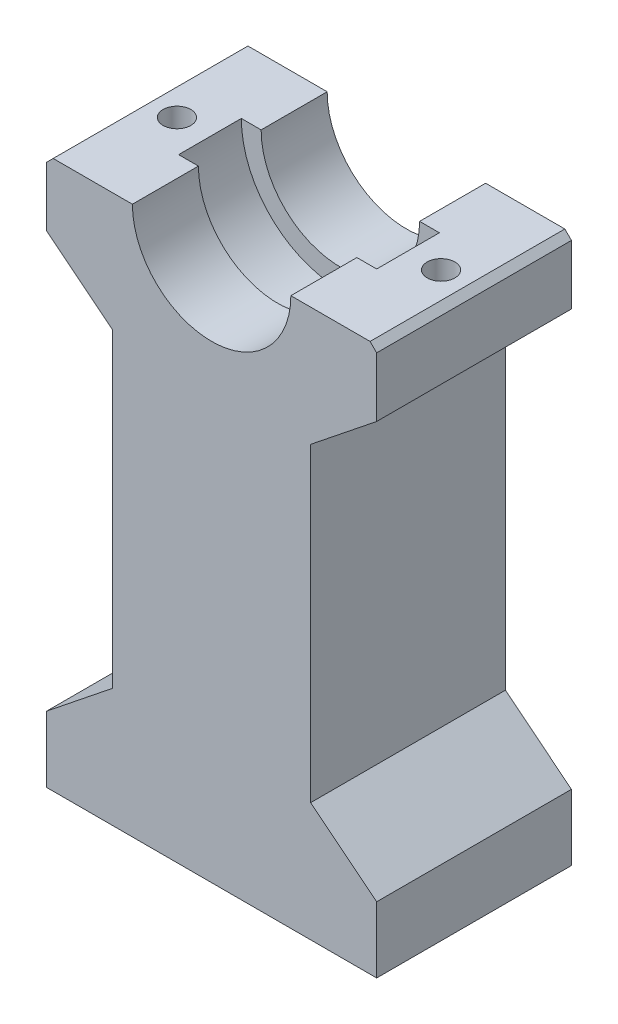
ISO-10303-21;
HEADER;
FILE_DESCRIPTION(('STEP AP214'),'2;1');
FILE_NAME('part.step','',(''),(''),'','','');
FILE_SCHEMA(('AUTOMOTIVE_DESIGN { 1 0 10303 214 1 1 1 1 }'));
ENDSEC;
DATA;
#1=APPLICATION_CONTEXT('core data for automotive mechanical design processes');
#2=APPLICATION_PROTOCOL_DEFINITION('international standard','automotive_design',2000,#1);
#3=PRODUCT_CONTEXT('',#1,'mechanical');
#4=PRODUCT('Part','Part','',(#3));
#5=PRODUCT_RELATED_PRODUCT_CATEGORY('part','',(#4));
#6=PRODUCT_DEFINITION_FORMATION('','',#4);
#7=PRODUCT_DEFINITION_CONTEXT('part definition',#1,'design');
#8=PRODUCT_DEFINITION('design','',#6,#7);
#9=PRODUCT_DEFINITION_SHAPE('','',#8);
#10=(LENGTH_UNIT() NAMED_UNIT(*) SI_UNIT(.MILLI.,.METRE.));
#11=(NAMED_UNIT(*) PLANE_ANGLE_UNIT() SI_UNIT($,.RADIAN.));
#12=(NAMED_UNIT(*) SI_UNIT($,.STERADIAN.) SOLID_ANGLE_UNIT());
#13=UNCERTAINTY_MEASURE_WITH_UNIT(LENGTH_MEASURE(1.E-05),#10,'distance_accuracy_value','');
#14=(GEOMETRIC_REPRESENTATION_CONTEXT(3) GLOBAL_UNCERTAINTY_ASSIGNED_CONTEXT((#13)) GLOBAL_UNIT_ASSIGNED_CONTEXT((#10,
#11,#12)) REPRESENTATION_CONTEXT('',''));
#15=CARTESIAN_POINT('',(0.,0.,0.));
#16=DIRECTION('',(0.,0.,1.));
#17=DIRECTION('',(1.,0.,0.));
#18=AXIS2_PLACEMENT_3D('',#15,#16,#17);
#19=CARTESIAN_POINT('',(-25.,0.,29.5));
#20=DIRECTION('',(0.,-1.,0.));
#21=DIRECTION('',(1.,0.,0.));
#22=AXIS2_PLACEMENT_3D('',#19,#20,#21);
#23=PLANE('',#22);
#24=DIRECTION('',(-1.,0.,0.));
#25=VECTOR('',#24,1.);
#26=CARTESIAN_POINT('',(-25.,0.,0.));
#27=LINE('',#26,#25);
#28=CARTESIAN_POINT('',(-12.,0.,0.));
#29=VERTEX_POINT('',#28);
#30=CARTESIAN_POINT('',(-24.,0.,0.));
#31=VERTEX_POINT('',#30);
#32=EDGE_CURVE('E276',#29,#31,#27,.T.);
#33=ORIENTED_EDGE('',*,*,#32,.T.);
#34=DIRECTION('',(0.,0.,1.));
#35=VECTOR('',#34,1.);
#36=CARTESIAN_POINT('',(-24.,0.,29.5));
#37=LINE('',#36,#35);
#38=CARTESIAN_POINT('',(-24.,0.,29.5));
#39=VERTEX_POINT('',#38);
#40=EDGE_CURVE('E11',#31,#39,#37,.T.);
#41=ORIENTED_EDGE('',*,*,#40,.T.);
#42=DIRECTION('',(-1.,0.,0.));
#43=VECTOR('',#42,1.);
#44=CARTESIAN_POINT('',(-25.,0.,29.5));
#45=LINE('',#44,#43);
#46=CARTESIAN_POINT('',(-12.,0.,29.5));
#47=VERTEX_POINT('',#46);
#48=EDGE_CURVE('E401',#47,#39,#45,.T.);
#49=ORIENTED_EDGE('',*,*,#48,.F.);
#50=DIRECTION('',(0.,0.,-1.));
#51=VECTOR('',#50,1.);
#52=CARTESIAN_POINT('',(-12.,0.,29.5));
#53=LINE('',#52,#51);
#54=CARTESIAN_POINT('',(-12.,0.,19.5));
#55=VERTEX_POINT('',#54);
#56=EDGE_CURVE('E326',#47,#55,#53,.T.);
#57=ORIENTED_EDGE('',*,*,#56,.T.);
#58=DIRECTION('',(-1.,0.,0.));
#59=VECTOR('',#58,1.);
#60=CARTESIAN_POINT('',(-25.,0.,19.5));
#61=LINE('',#60,#59);
#62=CARTESIAN_POINT('',(-15.,0.,19.5));
#63=VERTEX_POINT('',#62);
#64=EDGE_CURVE('E243',#55,#63,#61,.T.);
#65=ORIENTED_EDGE('',*,*,#64,.T.);
#66=DIRECTION('',(0.,0.,-1.));
#67=VECTOR('',#66,1.);
#68=CARTESIAN_POINT('',(-15.,0.,0.));
#69=LINE('',#68,#67);
#70=CARTESIAN_POINT('',(-15.,0.,10.));
#71=VERTEX_POINT('',#70);
#72=EDGE_CURVE('E228',#63,#71,#69,.T.);
#73=ORIENTED_EDGE('',*,*,#72,.T.);
#74=DIRECTION('',(1.,0.,0.));
#75=VECTOR('',#74,1.);
#76=CARTESIAN_POINT('',(-25.,0.,10.));
#77=LINE('',#76,#75);
#78=CARTESIAN_POINT('',(-12.,0.,10.));
#79=VERTEX_POINT('',#78);
#80=EDGE_CURVE('E219',#71,#79,#77,.T.);
#81=ORIENTED_EDGE('',*,*,#80,.T.);
#82=EDGE_CURVE('E325',#79,#29,#53,.T.);
#83=ORIENTED_EDGE('',*,*,#82,.T.);
#84=EDGE_LOOP('',(#33,#41,#49,#57,#65,#73,#81,#83));
#85=FACE_BOUND('',#84,.T.);
#86=CARTESIAN_POINT('',(-20.,0.,14.75));
#87=DIRECTION('',(0.,1.,0.));
#88=DIRECTION('',(0.,0.,1.));
#89=AXIS2_PLACEMENT_3D('',#86,#87,#88);
#90=CIRCLE('',#89,2.09999999999999);
#91=CARTESIAN_POINT('',(-20.,0.,16.85));
#92=VERTEX_POINT('',#91);
#93=EDGE_CURVE('E849',#92,#92,#90,.T.);
#94=ORIENTED_EDGE('',*,*,#93,.F.);
#95=EDGE_LOOP('',(#94));
#96=FACE_BOUND('',#95,.T.);
#97=ADVANCED_FACE('F40',(#85,#96),#23,.F.);
#98=CARTESIAN_POINT('',(0.,0.,29.5));
#99=DIRECTION('',(0.,0.,-1.));
#100=DIRECTION('',(-1.,0.,0.));
#101=AXIS2_PLACEMENT_3D('',#98,#99,#100);
#102=CYLINDRICAL_SURFACE('',#101,12.);
#103=DIRECTION('',(0.,0.,-1.));
#104=VECTOR('',#103,1.);
#105=CARTESIAN_POINT('',(12.,0.,29.5));
#106=LINE('',#105,#104);
#107=CARTESIAN_POINT('',(12.,0.,29.5));
#108=VERTEX_POINT('',#107);
#109=CARTESIAN_POINT('',(12.,0.,19.5));
#110=VERTEX_POINT('',#109);
#111=EDGE_CURVE('E329',#108,#110,#106,.T.);
#112=ORIENTED_EDGE('',*,*,#111,.T.);
#113=CARTESIAN_POINT('',(0.,0.,19.5));
#114=DIRECTION('',(0.,0.,1.));
#115=DIRECTION('',(1.,0.,0.));
#116=AXIS2_PLACEMENT_3D('',#113,#114,#115);
#117=CIRCLE('',#116,12.);
#118=EDGE_CURVE('E582',#110,#55,#117,.F.);
#119=ORIENTED_EDGE('',*,*,#118,.T.);
#120=ORIENTED_EDGE('',*,*,#56,.F.);
#121=CARTESIAN_POINT('',(0.,0.,29.5));
#122=DIRECTION('',(0.,0.,-1.));
#123=DIRECTION('',(1.,0.,0.));
#124=AXIS2_PLACEMENT_3D('',#121,#122,#123);
#125=CIRCLE('',#124,12.);
#126=EDGE_CURVE('E399',#108,#47,#125,.T.);
#127=ORIENTED_EDGE('',*,*,#126,.F.);
#128=EDGE_LOOP('',(#112,#119,#120,#127));
#129=FACE_BOUND('',#128,.T.);
#130=ADVANCED_FACE('F439',(#129),#102,.F.);
#131=CARTESIAN_POINT('',(25.,-83.,29.5));
#132=DIRECTION('',(0.,1.,0.));
#133=DIRECTION('',(0.,0.,1.));
#134=AXIS2_PLACEMENT_3D('',#131,#132,#133);
#135=PLANE('',#134);
#136=CARTESIAN_POINT('',(0.,-83.,23.3625));
#137=DIRECTION('',(0.,-1.,0.));
#138=DIRECTION('',(0.,0.,-1.));
#139=AXIS2_PLACEMENT_3D('',#136,#137,#138);
#140=CIRCLE('',#139,2.1);
#141=CARTESIAN_POINT('',(0.,-83.,21.2625));
#142=VERTEX_POINT('',#141);
#143=EDGE_CURVE('E592',#142,#142,#140,.T.);
#144=ORIENTED_EDGE('',*,*,#143,.F.);
#145=EDGE_LOOP('',(#144));
#146=FACE_BOUND('',#145,.T.);
#147=CARTESIAN_POINT('',(0.,-83.,6.1375));
#148=DIRECTION('',(0.,-1.,0.));
#149=DIRECTION('',(0.,0.,-1.));
#150=AXIS2_PLACEMENT_3D('',#147,#148,#149);
#151=CIRCLE('',#150,2.1);
#152=CARTESIAN_POINT('',(0.,-83.,4.0375));
#153=VERTEX_POINT('',#152);
#154=EDGE_CURVE('E597',#153,#153,#151,.T.);
#155=ORIENTED_EDGE('',*,*,#154,.F.);
#156=EDGE_LOOP('',(#155));
#157=FACE_BOUND('',#156,.T.);
#158=DIRECTION('',(1.,0.,0.));
#159=VECTOR('',#158,1.);
#160=CARTESIAN_POINT('',(25.,-83.,0.));
#161=LINE('',#160,#159);
#162=CARTESIAN_POINT('',(-25.,-83.,0.));
#163=VERTEX_POINT('',#162);
#164=CARTESIAN_POINT('',(25.,-83.,0.));
#165=VERTEX_POINT('',#164);
#166=EDGE_CURVE('E289',#163,#165,#161,.T.);
#167=ORIENTED_EDGE('',*,*,#166,.T.);
#168=DIRECTION('',(0.,0.,-1.));
#169=VECTOR('',#168,1.);
#170=CARTESIAN_POINT('',(25.,-83.,29.5));
#171=LINE('',#170,#169);
#172=CARTESIAN_POINT('',(25.,-83.,29.5));
#173=VERTEX_POINT('',#172);
#174=EDGE_CURVE('E308',#173,#165,#171,.T.);
#175=ORIENTED_EDGE('',*,*,#174,.F.);
#176=DIRECTION('',(1.,0.,0.));
#177=VECTOR('',#176,1.);
#178=CARTESIAN_POINT('',(25.,-83.,29.5));
#179=LINE('',#178,#177);
#180=CARTESIAN_POINT('',(-25.,-83.,29.5));
#181=VERTEX_POINT('',#180);
#182=EDGE_CURVE('E412',#181,#173,#179,.T.);
#183=ORIENTED_EDGE('',*,*,#182,.F.);
#184=DIRECTION('',(0.,0.,-1.));
#185=VECTOR('',#184,1.);
#186=CARTESIAN_POINT('',(-25.,-83.,29.5));
#187=LINE('',#186,#185);
#188=EDGE_CURVE('E311',#181,#163,#187,.T.);
#189=ORIENTED_EDGE('',*,*,#188,.T.);
#190=EDGE_LOOP('',(#167,#175,#183,#189));
#191=FACE_BOUND('',#190,.T.);
#192=CARTESIAN_POINT('',(10.,-83.,14.75));
#193=DIRECTION('',(0.,-1.,0.));
#194=DIRECTION('',(0.,0.,1.));
#195=AXIS2_PLACEMENT_3D('',#192,#193,#194);
#196=CIRCLE('',#195,2.475);
#197=CARTESIAN_POINT('',(10.,-83.,12.275));
#198=VERTEX_POINT('',#197);
#199=CARTESIAN_POINT('',(10.,-83.,17.225));
#200=VERTEX_POINT('',#199);
#201=EDGE_CURVE('E361',#198,#200,#196,.T.);
#202=ORIENTED_EDGE('',*,*,#201,.F.);
#203=DIRECTION('',(1.,0.,0.));
#204=VECTOR('',#203,1.);
#205=CARTESIAN_POINT('',(-10.,-83.,12.275));
#206=LINE('',#205,#204);
#207=CARTESIAN_POINT('',(-10.,-83.,12.275));
#208=VERTEX_POINT('',#207);
#209=EDGE_CURVE('E380',#208,#198,#206,.T.);
#210=ORIENTED_EDGE('',*,*,#209,.F.);
#211=CARTESIAN_POINT('',(-10.,-83.,14.75));
#212=DIRECTION('',(0.,-1.,0.));
#213=DIRECTION('',(0.,0.,-1.));
#214=AXIS2_PLACEMENT_3D('',#211,#212,#213);
#215=CIRCLE('',#214,2.475);
#216=CARTESIAN_POINT('',(-10.,-83.,17.225));
#217=VERTEX_POINT('',#216);
#218=EDGE_CURVE('E373',#217,#208,#215,.T.);
#219=ORIENTED_EDGE('',*,*,#218,.F.);
#220=DIRECTION('',(-1.,0.,0.));
#221=VECTOR('',#220,1.);
#222=CARTESIAN_POINT('',(-10.,-83.,17.225));
#223=LINE('',#222,#221);
#224=EDGE_CURVE('E367',#200,#217,#223,.T.);
#225=ORIENTED_EDGE('',*,*,#224,.F.);
#226=EDGE_LOOP('',(#202,#210,#219,#225));
#227=FACE_BOUND('',#226,.T.);
#228=ADVANCED_FACE('F444',(#146,#157,#191,#227),#135,.F.);
#229=CARTESIAN_POINT('',(25.,-10.,29.5));
#230=DIRECTION('',(-0.624695047554423,0.780868809443031,0.));
#231=DIRECTION('',(-0.780868809443031,-0.624695047554423,0.));
#232=AXIS2_PLACEMENT_3D('',#229,#230,#231);
#233=PLANE('',#232);
#234=CARTESIAN_POINT('',(20.,-14.,14.75));
#235=DIRECTION('',(-0.624695047554423,0.780868809443031,0.));
#236=DIRECTION('',(0.780868809443031,0.624695047554423,0.));
#237=AXIS2_PLACEMENT_3D('',#234,#235,#236);
#238=ELLIPSE('',#237,2.68931217972178,2.09999999999999);
#239=CARTESIAN_POINT('',(22.1,-12.32,14.75));
#240=VERTEX_POINT('',#239);
#241=EDGE_CURVE('E238',#240,#240,#238,.T.);
#242=ORIENTED_EDGE('',*,*,#241,.T.);
#243=EDGE_LOOP('',(#242));
#244=FACE_BOUND('',#243,.T.);
#245=DIRECTION('',(0.780868809443031,0.624695047554423,0.));
#246=VECTOR('',#245,1.);
#247=CARTESIAN_POINT('',(25.,-10.,0.));
#248=LINE('',#247,#246);
#249=CARTESIAN_POINT('',(15.,-18.,0.));
#250=VERTEX_POINT('',#249);
#251=CARTESIAN_POINT('',(25.,-10.,0.));
#252=VERTEX_POINT('',#251);
#253=EDGE_CURVE('E391',#250,#252,#248,.T.);
#254=ORIENTED_EDGE('',*,*,#253,.T.);
#255=DIRECTION('',(0.,0.,-1.));
#256=VECTOR('',#255,1.);
#257=CARTESIAN_POINT('',(25.,-10.,29.5));
#258=LINE('',#257,#256);
#259=CARTESIAN_POINT('',(25.,-10.,29.5));
#260=VERTEX_POINT('',#259);
#261=EDGE_CURVE('E332',#260,#252,#258,.T.);
#262=ORIENTED_EDGE('',*,*,#261,.F.);
#263=DIRECTION('',(0.780868809443031,0.624695047554423,0.));
#264=VECTOR('',#263,1.);
#265=CARTESIAN_POINT('',(25.,-10.,29.5));
#266=LINE('',#265,#264);
#267=CARTESIAN_POINT('',(15.,-18.,29.5));
#268=VERTEX_POINT('',#267);
#269=EDGE_CURVE('E297',#268,#260,#266,.T.);
#270=ORIENTED_EDGE('',*,*,#269,.F.);
#271=DIRECTION('',(0.,0.,-1.));
#272=VECTOR('',#271,1.);
#273=CARTESIAN_POINT('',(15.,-18.,29.5));
#274=LINE('',#273,#272);
#275=EDGE_CURVE('E298',#268,#250,#274,.T.);
#276=ORIENTED_EDGE('',*,*,#275,.T.);
#277=EDGE_LOOP('',(#254,#262,#270,#276));
#278=FACE_BOUND('',#277,.T.);
#279=ADVANCED_FACE('F458',(#244,#278),#233,.F.);
#280=CARTESIAN_POINT('',(25.,0.,29.5));
#281=DIRECTION('',(-1.,0.,0.));
#282=DIRECTION('',(0.,0.,1.));
#283=AXIS2_PLACEMENT_3D('',#280,#281,#282);
#284=PLANE('',#283);
#285=DIRECTION('',(0.,1.,0.));
#286=VECTOR('',#285,1.);
#287=CARTESIAN_POINT('',(25.,0.,0.));
#288=LINE('',#287,#286);
#289=CARTESIAN_POINT('',(25.,-1.00000000000003,0.));
#290=VERTEX_POINT('',#289);
#291=EDGE_CURVE('E421',#252,#290,#288,.T.);
#292=ORIENTED_EDGE('',*,*,#291,.T.);
#293=DIRECTION('',(0.,0.,1.));
#294=VECTOR('',#293,1.);
#295=CARTESIAN_POINT('',(25.,-1.00000000000003,29.5));
#296=LINE('',#295,#294);
#297=CARTESIAN_POINT('',(25.,-1.00000000000003,29.5));
#298=VERTEX_POINT('',#297);
#299=EDGE_CURVE('E255',#290,#298,#296,.T.);
#300=ORIENTED_EDGE('',*,*,#299,.T.);
#301=DIRECTION('',(0.,1.,0.));
#302=VECTOR('',#301,1.);
#303=CARTESIAN_POINT('',(25.,0.,29.5));
#304=LINE('',#303,#302);
#305=EDGE_CURVE('E394',#260,#298,#304,.T.);
#306=ORIENTED_EDGE('',*,*,#305,.F.);
#307=ORIENTED_EDGE('',*,*,#261,.T.);
#308=EDGE_LOOP('',(#292,#300,#306,#307));
#309=FACE_BOUND('',#308,.T.);
#310=ADVANCED_FACE('F454',(#309),#284,.F.);
#311=CARTESIAN_POINT('',(12.,0.,29.5));
#312=DIRECTION('',(0.,-1.,0.));
#313=DIRECTION('',(1.,0.,0.));
#314=AXIS2_PLACEMENT_3D('',#311,#312,#313);
#315=PLANE('',#314);
#316=CARTESIAN_POINT('',(20.,0.,14.75));
#317=DIRECTION('',(0.,1.,0.));
#318=DIRECTION('',(0.,0.,1.));
#319=AXIS2_PLACEMENT_3D('',#316,#317,#318);
#320=CIRCLE('',#319,2.09999999999999);
#321=CARTESIAN_POINT('',(20.,0.,16.85));
#322=VERTEX_POINT('',#321);
#323=EDGE_CURVE('E851',#322,#322,#320,.T.);
#324=ORIENTED_EDGE('',*,*,#323,.F.);
#325=EDGE_LOOP('',(#324));
#326=FACE_BOUND('',#325,.T.);
#327=DIRECTION('',(-1.,0.,0.));
#328=VECTOR('',#327,1.);
#329=CARTESIAN_POINT('',(12.,0.,29.5));
#330=LINE('',#329,#328);
#331=CARTESIAN_POINT('',(24.,0.,29.5));
#332=VERTEX_POINT('',#331);
#333=EDGE_CURVE('E397',#332,#108,#330,.T.);
#334=ORIENTED_EDGE('',*,*,#333,.F.);
#335=DIRECTION('',(0.,0.,-1.));
#336=VECTOR('',#335,1.);
#337=CARTESIAN_POINT('',(24.,0.,29.5));
#338=LINE('',#337,#336);
#339=CARTESIAN_POINT('',(24.,0.,0.));
#340=VERTEX_POINT('',#339);
#341=EDGE_CURVE('E245',#332,#340,#338,.T.);
#342=ORIENTED_EDGE('',*,*,#341,.T.);
#343=DIRECTION('',(-1.,0.,0.));
#344=VECTOR('',#343,1.);
#345=CARTESIAN_POINT('',(12.,0.,0.));
#346=LINE('',#345,#344);
#347=CARTESIAN_POINT('',(12.,0.,0.));
#348=VERTEX_POINT('',#347);
#349=EDGE_CURVE('E424',#340,#348,#346,.T.);
#350=ORIENTED_EDGE('',*,*,#349,.T.);
#351=CARTESIAN_POINT('',(12.,0.,10.));
#352=VERTEX_POINT('',#351);
#353=EDGE_CURVE('E328',#352,#348,#106,.T.);
#354=ORIENTED_EDGE('',*,*,#353,.F.);
#355=DIRECTION('',(1.,0.,0.));
#356=VECTOR('',#355,1.);
#357=CARTESIAN_POINT('',(12.,0.,10.));
#358=LINE('',#357,#356);
#359=CARTESIAN_POINT('',(15.,0.,10.));
#360=VERTEX_POINT('',#359);
#361=EDGE_CURVE('E585',#352,#360,#358,.T.);
#362=ORIENTED_EDGE('',*,*,#361,.T.);
#363=DIRECTION('',(0.,0.,-1.));
#364=VECTOR('',#363,1.);
#365=CARTESIAN_POINT('',(15.,0.,0.));
#366=LINE('',#365,#364);
#367=CARTESIAN_POINT('',(15.,0.,19.5));
#368=VERTEX_POINT('',#367);
#369=EDGE_CURVE('E236',#360,#368,#366,.F.);
#370=ORIENTED_EDGE('',*,*,#369,.T.);
#371=DIRECTION('',(-1.,0.,0.));
#372=VECTOR('',#371,1.);
#373=CARTESIAN_POINT('',(12.,0.,19.5));
#374=LINE('',#373,#372);
#375=EDGE_CURVE('E584',#368,#110,#374,.T.);
#376=ORIENTED_EDGE('',*,*,#375,.T.);
#377=ORIENTED_EDGE('',*,*,#111,.F.);
#378=EDGE_LOOP('',(#334,#342,#350,#354,#362,#370,#376,#377));
#379=FACE_BOUND('',#378,.T.);
#380=ADVANCED_FACE('F451',(#326,#379),#315,.F.);
#381=ORIENTED_EDGE('',*,*,#82,.F.);
#382=CARTESIAN_POINT('',(0.,0.,10.));
#383=DIRECTION('',(0.,0.,-1.));
#384=DIRECTION('',(-1.,0.,0.));
#385=AXIS2_PLACEMENT_3D('',#382,#383,#384);
#386=CIRCLE('',#385,12.);
#387=EDGE_CURVE('E225',#79,#352,#386,.F.);
#388=ORIENTED_EDGE('',*,*,#387,.T.);
#389=ORIENTED_EDGE('',*,*,#353,.T.);
#390=CARTESIAN_POINT('',(0.,0.,0.));
#391=DIRECTION('',(0.,0.,-1.));
#392=DIRECTION('',(1.,0.,0.));
#393=AXIS2_PLACEMENT_3D('',#390,#391,#392);
#394=CIRCLE('',#393,12.);
#395=EDGE_CURVE('E280',#348,#29,#394,.T.);
#396=ORIENTED_EDGE('',*,*,#395,.T.);
#397=EDGE_LOOP('',(#381,#388,#389,#396));
#398=FACE_BOUND('',#397,.T.);
#399=ADVANCED_FACE('F429',(#398),#102,.F.);
#400=CARTESIAN_POINT('',(-25.,-9.99999999999994,29.5));
#401=DIRECTION('',(1.,0.,0.));
#402=DIRECTION('',(0.,0.,-1.));
#403=AXIS2_PLACEMENT_3D('',#400,#401,#402);
#404=PLANE('',#403);
#405=DIRECTION('',(0.,-1.,0.));
#406=VECTOR('',#405,1.);
#407=CARTESIAN_POINT('',(-25.,-9.99999999999994,29.5));
#408=LINE('',#407,#406);
#409=CARTESIAN_POINT('',(-25.,-1.00000000000001,29.5));
#410=VERTEX_POINT('',#409);
#411=CARTESIAN_POINT('',(-25.,-9.99999999999994,29.5));
#412=VERTEX_POINT('',#411);
#413=EDGE_CURVE('E267',#410,#412,#408,.T.);
#414=ORIENTED_EDGE('',*,*,#413,.F.);
#415=DIRECTION('',(0.,0.,-1.));
#416=VECTOR('',#415,1.);
#417=CARTESIAN_POINT('',(-25.,-1.00000000000001,29.5));
#418=LINE('',#417,#416);
#419=CARTESIAN_POINT('',(-25.,-1.00000000000001,0.));
#420=VERTEX_POINT('',#419);
#421=EDGE_CURVE('E48',#410,#420,#418,.T.);
#422=ORIENTED_EDGE('',*,*,#421,.T.);
#423=DIRECTION('',(0.,-1.,0.));
#424=VECTOR('',#423,1.);
#425=CARTESIAN_POINT('',(-25.,-9.99999999999994,0.));
#426=LINE('',#425,#424);
#427=CARTESIAN_POINT('',(-25.,-9.99999999999994,0.));
#428=VERTEX_POINT('',#427);
#429=EDGE_CURVE('E265',#420,#428,#426,.T.);
#430=ORIENTED_EDGE('',*,*,#429,.T.);
#431=DIRECTION('',(0.,0.,-1.));
#432=VECTOR('',#431,1.);
#433=CARTESIAN_POINT('',(-25.,-9.99999999999994,29.5));
#434=LINE('',#433,#432);
#435=EDGE_CURVE('E323',#412,#428,#434,.T.);
#436=ORIENTED_EDGE('',*,*,#435,.F.);
#437=EDGE_LOOP('',(#414,#422,#430,#436));
#438=FACE_BOUND('',#437,.T.);
#439=ADVANCED_FACE('F263',(#438),#404,.F.);
#440=CARTESIAN_POINT('',(-25.,-9.99999999999994,29.5));
#441=DIRECTION('',(0.624695047554427,0.780868809443028,0.));
#442=DIRECTION('',(-0.780868809443028,0.624695047554427,0.));
#443=AXIS2_PLACEMENT_3D('',#440,#441,#442);
#444=PLANE('',#443);
#445=CARTESIAN_POINT('',(-20.,-14.,14.75));
#446=DIRECTION('',(0.624695047554427,0.780868809443028,0.));
#447=DIRECTION('',(-0.780868809443028,0.624695047554427,0.));
#448=AXIS2_PLACEMENT_3D('',#445,#446,#447);
#449=ELLIPSE('',#448,2.68931217972179,2.09999999999999);
#450=CARTESIAN_POINT('',(-22.1,-12.32,14.75));
#451=VERTEX_POINT('',#450);
#452=EDGE_CURVE('E538',#451,#451,#449,.T.);
#453=ORIENTED_EDGE('',*,*,#452,.T.);
#454=EDGE_LOOP('',(#453));
#455=FACE_BOUND('',#454,.T.);
#456=DIRECTION('',(0.780868809443028,-0.624695047554427,0.));
#457=VECTOR('',#456,1.);
#458=CARTESIAN_POINT('',(-25.,-9.99999999999994,0.));
#459=LINE('',#458,#457);
#460=CARTESIAN_POINT('',(-15.,-18.,0.));
#461=VERTEX_POINT('',#460);
#462=EDGE_CURVE('E275',#428,#461,#459,.T.);
#463=ORIENTED_EDGE('',*,*,#462,.T.);
#464=DIRECTION('',(0.,0.,-1.));
#465=VECTOR('',#464,1.);
#466=CARTESIAN_POINT('',(-15.,-18.,29.5));
#467=LINE('',#466,#465);
#468=CARTESIAN_POINT('',(-15.,-18.,29.5));
#469=VERTEX_POINT('',#468);
#470=EDGE_CURVE('E320',#469,#461,#467,.T.);
#471=ORIENTED_EDGE('',*,*,#470,.F.);
#472=DIRECTION('',(0.780868809443028,-0.624695047554427,0.));
#473=VECTOR('',#472,1.);
#474=CARTESIAN_POINT('',(-25.,-9.99999999999994,29.5));
#475=LINE('',#474,#473);
#476=EDGE_CURVE('E404',#412,#469,#475,.T.);
#477=ORIENTED_EDGE('',*,*,#476,.F.);
#478=ORIENTED_EDGE('',*,*,#435,.T.);
#479=EDGE_LOOP('',(#463,#471,#477,#478));
#480=FACE_BOUND('',#479,.T.);
#481=ADVANCED_FACE('F528',(#455,#480),#444,.F.);
#482=CARTESIAN_POINT('',(-15.,-18.,29.5));
#483=DIRECTION('',(1.,0.,0.));
#484=DIRECTION('',(0.,0.,-1.));
#485=AXIS2_PLACEMENT_3D('',#482,#483,#484);
#486=PLANE('',#485);
#487=DIRECTION('',(0.,-1.,0.));
#488=VECTOR('',#487,1.);
#489=CARTESIAN_POINT('',(-15.,-18.,0.));
#490=LINE('',#489,#488);
#491=CARTESIAN_POINT('',(-15.,-65.,0.));
#492=VERTEX_POINT('',#491);
#493=EDGE_CURVE('E278',#461,#492,#490,.T.);
#494=ORIENTED_EDGE('',*,*,#493,.T.);
#495=DIRECTION('',(0.,0.,-1.));
#496=VECTOR('',#495,1.);
#497=CARTESIAN_POINT('',(-15.,-65.,29.5));
#498=LINE('',#497,#496);
#499=CARTESIAN_POINT('',(-15.,-65.,29.5));
#500=VERTEX_POINT('',#499);
#501=EDGE_CURVE('E317',#500,#492,#498,.T.);
#502=ORIENTED_EDGE('',*,*,#501,.F.);
#503=DIRECTION('',(0.,-1.,0.));
#504=VECTOR('',#503,1.);
#505=CARTESIAN_POINT('',(-15.,-18.,29.5));
#506=LINE('',#505,#504);
#507=EDGE_CURVE('E406',#469,#500,#506,.T.);
#508=ORIENTED_EDGE('',*,*,#507,.F.);
#509=ORIENTED_EDGE('',*,*,#470,.T.);
#510=EDGE_LOOP('',(#494,#502,#508,#509));
#511=FACE_BOUND('',#510,.T.);
#512=ADVANCED_FACE('F525',(#511),#486,.F.);
#513=CARTESIAN_POINT('',(-15.,-65.,29.5));
#514=DIRECTION('',(0.624695047554425,-0.78086880944303,0.));
#515=DIRECTION('',(0.78086880944303,0.624695047554425,0.));
#516=AXIS2_PLACEMENT_3D('',#513,#514,#515);
#517=PLANE('',#516);
#518=DIRECTION('',(-0.78086880944303,-0.624695047554425,0.));
#519=VECTOR('',#518,1.);
#520=CARTESIAN_POINT('',(-15.,-65.,0.));
#521=LINE('',#520,#519);
#522=CARTESIAN_POINT('',(-25.,-73.,0.));
#523=VERTEX_POINT('',#522);
#524=EDGE_CURVE('E285',#492,#523,#521,.T.);
#525=ORIENTED_EDGE('',*,*,#524,.T.);
#526=DIRECTION('',(0.,0.,-1.));
#527=VECTOR('',#526,1.);
#528=CARTESIAN_POINT('',(-25.,-73.,29.5));
#529=LINE('',#528,#527);
#530=CARTESIAN_POINT('',(-25.,-73.,29.5));
#531=VERTEX_POINT('',#530);
#532=EDGE_CURVE('E314',#531,#523,#529,.T.);
#533=ORIENTED_EDGE('',*,*,#532,.F.);
#534=DIRECTION('',(-0.78086880944303,-0.624695047554425,0.));
#535=VECTOR('',#534,1.);
#536=CARTESIAN_POINT('',(-15.,-65.,29.5));
#537=LINE('',#536,#535);
#538=EDGE_CURVE('E408',#500,#531,#537,.T.);
#539=ORIENTED_EDGE('',*,*,#538,.F.);
#540=ORIENTED_EDGE('',*,*,#501,.T.);
#541=EDGE_LOOP('',(#525,#533,#539,#540));
#542=FACE_BOUND('',#541,.T.);
#543=ADVANCED_FACE('F521',(#542),#517,.F.);
#544=CARTESIAN_POINT('',(-25.,-83.,29.5));
#545=DIRECTION('',(1.,0.,0.));
#546=DIRECTION('',(0.,0.,-1.));
#547=AXIS2_PLACEMENT_3D('',#544,#545,#546);
#548=PLANE('',#547);
#549=DIRECTION('',(0.,-1.,0.));
#550=VECTOR('',#549,1.);
#551=CARTESIAN_POINT('',(-25.,-83.,0.));
#552=LINE('',#551,#550);
#553=EDGE_CURVE('E287',#523,#163,#552,.T.);
#554=ORIENTED_EDGE('',*,*,#553,.T.);
#555=ORIENTED_EDGE('',*,*,#188,.F.);
#556=DIRECTION('',(0.,-1.,0.));
#557=VECTOR('',#556,1.);
#558=CARTESIAN_POINT('',(-25.,-83.,29.5));
#559=LINE('',#558,#557);
#560=EDGE_CURVE('E410',#531,#181,#559,.T.);
#561=ORIENTED_EDGE('',*,*,#560,.F.);
#562=ORIENTED_EDGE('',*,*,#532,.T.);
#563=EDGE_LOOP('',(#554,#555,#561,#562));
#564=FACE_BOUND('',#563,.T.);
#565=ADVANCED_FACE('F518',(#564),#548,.F.);
#566=CARTESIAN_POINT('',(25.,-73.,29.5));
#567=DIRECTION('',(-1.,0.,0.));
#568=DIRECTION('',(0.,0.,1.));
#569=AXIS2_PLACEMENT_3D('',#566,#567,#568);
#570=PLANE('',#569);
#571=DIRECTION('',(0.,1.,0.));
#572=VECTOR('',#571,1.);
#573=CARTESIAN_POINT('',(25.,-73.,0.));
#574=LINE('',#573,#572);
#575=CARTESIAN_POINT('',(25.,-73.,0.));
#576=VERTEX_POINT('',#575);
#577=EDGE_CURVE('E291',#165,#576,#574,.T.);
#578=ORIENTED_EDGE('',*,*,#577,.T.);
#579=DIRECTION('',(0.,0.,-1.));
#580=VECTOR('',#579,1.);
#581=CARTESIAN_POINT('',(25.,-73.,29.5));
#582=LINE('',#581,#580);
#583=CARTESIAN_POINT('',(25.,-73.,29.5));
#584=VERTEX_POINT('',#583);
#585=EDGE_CURVE('E305',#584,#576,#582,.T.);
#586=ORIENTED_EDGE('',*,*,#585,.F.);
#587=DIRECTION('',(0.,1.,0.));
#588=VECTOR('',#587,1.);
#589=CARTESIAN_POINT('',(25.,-73.,29.5));
#590=LINE('',#589,#588);
#591=EDGE_CURVE('E414',#173,#584,#590,.T.);
#592=ORIENTED_EDGE('',*,*,#591,.F.);
#593=ORIENTED_EDGE('',*,*,#174,.T.);
#594=EDGE_LOOP('',(#578,#586,#592,#593));
#595=FACE_BOUND('',#594,.T.);
#596=ADVANCED_FACE('F516',(#595),#570,.F.);
#597=CARTESIAN_POINT('',(15.,-65.,29.5));
#598=DIRECTION('',(-0.624695047554425,-0.78086880944303,0.));
#599=DIRECTION('',(0.78086880944303,-0.624695047554425,0.));
#600=AXIS2_PLACEMENT_3D('',#597,#598,#599);
#601=PLANE('',#600);
#602=DIRECTION('',(-0.78086880944303,0.624695047554425,0.));
#603=VECTOR('',#602,1.);
#604=CARTESIAN_POINT('',(15.,-65.,0.));
#605=LINE('',#604,#603);
#606=CARTESIAN_POINT('',(15.,-65.,0.));
#607=VERTEX_POINT('',#606);
#608=EDGE_CURVE('E293',#576,#607,#605,.T.);
#609=ORIENTED_EDGE('',*,*,#608,.T.);
#610=DIRECTION('',(0.,0.,-1.));
#611=VECTOR('',#610,1.);
#612=CARTESIAN_POINT('',(15.,-65.,29.5));
#613=LINE('',#612,#611);
#614=CARTESIAN_POINT('',(15.,-65.,29.5));
#615=VERTEX_POINT('',#614);
#616=EDGE_CURVE('E301',#615,#607,#613,.T.);
#617=ORIENTED_EDGE('',*,*,#616,.F.);
#618=DIRECTION('',(-0.78086880944303,0.624695047554425,0.));
#619=VECTOR('',#618,1.);
#620=CARTESIAN_POINT('',(15.,-65.,29.5));
#621=LINE('',#620,#619);
#622=EDGE_CURVE('E416',#584,#615,#621,.T.);
#623=ORIENTED_EDGE('',*,*,#622,.F.);
#624=ORIENTED_EDGE('',*,*,#585,.T.);
#625=EDGE_LOOP('',(#609,#617,#623,#624));
#626=FACE_BOUND('',#625,.T.);
#627=ADVANCED_FACE('F562',(#626),#601,.F.);
#628=CARTESIAN_POINT('',(15.,-18.,29.5));
#629=DIRECTION('',(-1.,0.,0.));
#630=DIRECTION('',(0.,0.,1.));
#631=AXIS2_PLACEMENT_3D('',#628,#629,#630);
#632=PLANE('',#631);
#633=DIRECTION('',(0.,1.,0.));
#634=VECTOR('',#633,1.);
#635=CARTESIAN_POINT('',(15.,-18.,0.));
#636=LINE('',#635,#634);
#637=EDGE_CURVE('E295',#607,#250,#636,.T.);
#638=ORIENTED_EDGE('',*,*,#637,.T.);
#639=ORIENTED_EDGE('',*,*,#275,.F.);
#640=DIRECTION('',(0.,1.,0.));
#641=VECTOR('',#640,1.);
#642=CARTESIAN_POINT('',(15.,-18.,29.5));
#643=LINE('',#642,#641);
#644=EDGE_CURVE('E302',#615,#268,#643,.T.);
#645=ORIENTED_EDGE('',*,*,#644,.F.);
#646=ORIENTED_EDGE('',*,*,#616,.T.);
#647=EDGE_LOOP('',(#638,#639,#645,#646));
#648=FACE_BOUND('',#647,.T.);
#649=ADVANCED_FACE('F568',(#648),#632,.F.);
#650=CARTESIAN_POINT('',(0.,0.,29.5));
#651=DIRECTION('',(0.,0.,1.));
#652=DIRECTION('',(1.,0.,0.));
#653=AXIS2_PLACEMENT_3D('',#650,#651,#652);
#654=PLANE('',#653);
#655=ORIENTED_EDGE('',*,*,#305,.T.);
#656=DIRECTION('',(0.707106781186548,-0.707106781186548,0.));
#657=VECTOR('',#656,1.);
#658=CARTESIAN_POINT('',(12.,12.,29.5));
#659=LINE('',#658,#657);
#660=EDGE_CURVE('E258',#298,#332,#659,.F.);
#661=ORIENTED_EDGE('',*,*,#660,.T.);
#662=ORIENTED_EDGE('',*,*,#333,.T.);
#663=ORIENTED_EDGE('',*,*,#126,.T.);
#664=ORIENTED_EDGE('',*,*,#48,.T.);
#665=DIRECTION('',(0.707106781186552,0.707106781186543,0.));
#666=VECTOR('',#665,1.);
#667=CARTESIAN_POINT('',(-11.9999999999998,12.,29.5));
#668=LINE('',#667,#666);
#669=EDGE_CURVE('E55',#39,#410,#668,.F.);
#670=ORIENTED_EDGE('',*,*,#669,.T.);
#671=ORIENTED_EDGE('',*,*,#413,.T.);
#672=ORIENTED_EDGE('',*,*,#476,.T.);
#673=ORIENTED_EDGE('',*,*,#507,.T.);
#674=ORIENTED_EDGE('',*,*,#538,.T.);
#675=ORIENTED_EDGE('',*,*,#560,.T.);
#676=ORIENTED_EDGE('',*,*,#182,.T.);
#677=ORIENTED_EDGE('',*,*,#591,.T.);
#678=ORIENTED_EDGE('',*,*,#622,.T.);
#679=ORIENTED_EDGE('',*,*,#644,.T.);
#680=ORIENTED_EDGE('',*,*,#269,.T.);
#681=EDGE_LOOP('',(#655,#661,#662,#663,#664,#670,#671,#672,#673,#674,#675,#676,#677,#678,#679,#680));
#682=FACE_BOUND('',#681,.T.);
#683=ADVANCED_FACE('F551',(#682),#654,.T.);
#684=CARTESIAN_POINT('',(0.,0.,0.));
#685=DIRECTION('',(0.,0.,1.));
#686=DIRECTION('',(1.,0.,0.));
#687=AXIS2_PLACEMENT_3D('',#684,#685,#686);
#688=PLANE('',#687);
#689=ORIENTED_EDGE('',*,*,#349,.F.);
#690=DIRECTION('',(-0.707106781186548,0.707106781186548,0.));
#691=VECTOR('',#690,1.);
#692=CARTESIAN_POINT('',(24.,0.,0.));
#693=LINE('',#692,#691);
#694=EDGE_CURVE('E253',#340,#290,#693,.F.);
#695=ORIENTED_EDGE('',*,*,#694,.T.);
#696=ORIENTED_EDGE('',*,*,#291,.F.);
#697=ORIENTED_EDGE('',*,*,#253,.F.);
#698=ORIENTED_EDGE('',*,*,#637,.F.);
#699=ORIENTED_EDGE('',*,*,#608,.F.);
#700=ORIENTED_EDGE('',*,*,#577,.F.);
#701=ORIENTED_EDGE('',*,*,#166,.F.);
#702=ORIENTED_EDGE('',*,*,#553,.F.);
#703=ORIENTED_EDGE('',*,*,#524,.F.);
#704=ORIENTED_EDGE('',*,*,#493,.F.);
#705=ORIENTED_EDGE('',*,*,#462,.F.);
#706=ORIENTED_EDGE('',*,*,#429,.F.);
#707=DIRECTION('',(-0.707106781186552,-0.707106781186543,0.));
#708=VECTOR('',#707,1.);
#709=CARTESIAN_POINT('',(-25.,-1.00000000000001,0.));
#710=LINE('',#709,#708);
#711=EDGE_CURVE('E251',#420,#31,#710,.F.);
#712=ORIENTED_EDGE('',*,*,#711,.T.);
#713=ORIENTED_EDGE('',*,*,#32,.F.);
#714=ORIENTED_EDGE('',*,*,#395,.F.);
#715=EDGE_LOOP('',(#689,#695,#696,#697,#698,#699,#700,#701,#702,#703,#704,#705,#706,#712,#713,#714));
#716=FACE_BOUND('',#715,.T.);
#717=ADVANCED_FACE('F272',(#716),#688,.F.);
#718=CARTESIAN_POINT('',(10.,-90.,14.75));
#719=DIRECTION('',(0.,1.,0.));
#720=DIRECTION('',(0.,0.,1.));
#721=AXIS2_PLACEMENT_3D('',#718,#719,#720);
#722=CYLINDRICAL_SURFACE('',#721,2.475);
#723=DIRECTION('',(0.,1.,0.));
#724=VECTOR('',#723,1.);
#725=CARTESIAN_POINT('',(10.,-90.,17.225));
#726=LINE('',#725,#724);
#727=CARTESIAN_POINT('',(10.,-89.5,17.225));
#728=VERTEX_POINT('',#727);
#729=EDGE_CURVE('E389',#728,#200,#726,.T.);
#730=ORIENTED_EDGE('',*,*,#729,.F.);
#731=CARTESIAN_POINT('',(10.,-89.5,14.75));
#732=DIRECTION('',(0.,1.,0.));
#733=DIRECTION('',(0.,0.,1.));
#734=AXIS2_PLACEMENT_3D('',#731,#732,#733);
#735=CIRCLE('',#734,2.475);
#736=CARTESIAN_POINT('',(10.,-89.5,12.275));
#737=VERTEX_POINT('',#736);
#738=EDGE_CURVE('E229',#728,#737,#735,.T.);
#739=ORIENTED_EDGE('',*,*,#738,.T.);
#740=DIRECTION('',(0.,1.,0.));
#741=VECTOR('',#740,1.);
#742=CARTESIAN_POINT('',(10.,-90.,12.275));
#743=LINE('',#742,#741);
#744=EDGE_CURVE('E383',#737,#198,#743,.T.);
#745=ORIENTED_EDGE('',*,*,#744,.T.);
#746=ORIENTED_EDGE('',*,*,#201,.T.);
#747=EDGE_LOOP('',(#730,#739,#745,#746));
#748=FACE_BOUND('',#747,.T.);
#749=ADVANCED_FACE('F492',(#748),#722,.T.);
#750=CARTESIAN_POINT('',(-10.,-90.,17.225));
#751=DIRECTION('',(0.,0.,-1.));
#752=DIRECTION('',(-1.,0.,0.));
#753=AXIS2_PLACEMENT_3D('',#750,#751,#752);
#754=PLANE('',#753);
#755=DIRECTION('',(0.,1.,0.));
#756=VECTOR('',#755,1.);
#757=CARTESIAN_POINT('',(-10.,-90.,17.225));
#758=LINE('',#757,#756);
#759=CARTESIAN_POINT('',(-10.,-89.5,17.225));
#760=VERTEX_POINT('',#759);
#761=EDGE_CURVE('E387',#760,#217,#758,.T.);
#762=ORIENTED_EDGE('',*,*,#761,.F.);
#763=DIRECTION('',(1.,0.,0.));
#764=VECTOR('',#763,1.);
#765=CARTESIAN_POINT('',(-10.,-89.5,17.225));
#766=LINE('',#765,#764);
#767=EDGE_CURVE('E349',#760,#728,#766,.T.);
#768=ORIENTED_EDGE('',*,*,#767,.T.);
#769=ORIENTED_EDGE('',*,*,#729,.T.);
#770=ORIENTED_EDGE('',*,*,#224,.T.);
#771=EDGE_LOOP('',(#762,#768,#769,#770));
#772=FACE_BOUND('',#771,.T.);
#773=ADVANCED_FACE('F504',(#772),#754,.F.);
#774=CARTESIAN_POINT('',(-10.,-90.,14.75));
#775=DIRECTION('',(0.,1.,0.));
#776=DIRECTION('',(0.,0.,1.));
#777=AXIS2_PLACEMENT_3D('',#774,#775,#776);
#778=CYLINDRICAL_SURFACE('',#777,2.475);
#779=DIRECTION('',(0.,1.,0.));
#780=VECTOR('',#779,1.);
#781=CARTESIAN_POINT('',(-10.,-90.,12.275));
#782=LINE('',#781,#780);
#783=CARTESIAN_POINT('',(-10.,-89.5,12.275));
#784=VERTEX_POINT('',#783);
#785=EDGE_CURVE('E385',#784,#208,#782,.T.);
#786=ORIENTED_EDGE('',*,*,#785,.F.);
#787=CARTESIAN_POINT('',(-10.,-89.5,14.75));
#788=DIRECTION('',(0.,1.,0.));
#789=DIRECTION('',(0.,0.,1.));
#790=AXIS2_PLACEMENT_3D('',#787,#788,#789);
#791=CIRCLE('',#790,2.475);
#792=EDGE_CURVE('E347',#784,#760,#791,.T.);
#793=ORIENTED_EDGE('',*,*,#792,.T.);
#794=ORIENTED_EDGE('',*,*,#761,.T.);
#795=ORIENTED_EDGE('',*,*,#218,.T.);
#796=EDGE_LOOP('',(#786,#793,#794,#795));
#797=FACE_BOUND('',#796,.T.);
#798=ADVANCED_FACE('F501',(#797),#778,.T.);
#799=CARTESIAN_POINT('',(-10.,-90.,12.275));
#800=DIRECTION('',(0.,0.,1.));
#801=DIRECTION('',(1.,0.,0.));
#802=AXIS2_PLACEMENT_3D('',#799,#800,#801);
#803=PLANE('',#802);
#804=ORIENTED_EDGE('',*,*,#744,.F.);
#805=DIRECTION('',(-1.,0.,0.));
#806=VECTOR('',#805,1.);
#807=CARTESIAN_POINT('',(-10.,-89.5,12.275));
#808=LINE('',#807,#806);
#809=EDGE_CURVE('E344',#737,#784,#808,.T.);
#810=ORIENTED_EDGE('',*,*,#809,.T.);
#811=ORIENTED_EDGE('',*,*,#785,.T.);
#812=ORIENTED_EDGE('',*,*,#209,.T.);
#813=EDGE_LOOP('',(#804,#810,#811,#812));
#814=FACE_BOUND('',#813,.T.);
#815=ADVANCED_FACE('F482',(#814),#803,.F.);
#816=CARTESIAN_POINT('',(10.,-90.,14.75));
#817=DIRECTION('',(0.,1.,0.));
#818=DIRECTION('',(0.,0.,1.));
#819=AXIS2_PLACEMENT_3D('',#816,#817,#818);
#820=PLANE('',#819);
#821=CARTESIAN_POINT('',(-10.,-90.,14.75));
#822=DIRECTION('',(0.,1.,0.));
#823=DIRECTION('',(0.,0.,1.));
#824=AXIS2_PLACEMENT_3D('',#821,#822,#823);
#825=CIRCLE('',#824,1.97500000000003);
#826=CARTESIAN_POINT('',(-10.,-90.,16.725));
#827=VERTEX_POINT('',#826);
#828=CARTESIAN_POINT('',(-10.,-90.,12.775));
#829=VERTEX_POINT('',#828);
#830=EDGE_CURVE('E339',#827,#829,#825,.F.);
#831=ORIENTED_EDGE('',*,*,#830,.T.);
#832=DIRECTION('',(1.,0.,0.));
#833=VECTOR('',#832,1.);
#834=CARTESIAN_POINT('',(10.,-90.,12.775));
#835=LINE('',#834,#833);
#836=CARTESIAN_POINT('',(10.,-90.,12.775));
#837=VERTEX_POINT('',#836);
#838=EDGE_CURVE('E341',#829,#837,#835,.T.);
#839=ORIENTED_EDGE('',*,*,#838,.T.);
#840=CARTESIAN_POINT('',(10.,-90.,14.75));
#841=DIRECTION('',(0.,1.,0.));
#842=DIRECTION('',(0.,0.,1.));
#843=AXIS2_PLACEMENT_3D('',#840,#841,#842);
#844=CIRCLE('',#843,1.97500000000003);
#845=CARTESIAN_POINT('',(10.,-90.,16.725));
#846=VERTEX_POINT('',#845);
#847=EDGE_CURVE('E335',#837,#846,#844,.F.);
#848=ORIENTED_EDGE('',*,*,#847,.T.);
#849=DIRECTION('',(-1.,0.,0.));
#850=VECTOR('',#849,1.);
#851=CARTESIAN_POINT('',(10.,-90.,16.725));
#852=LINE('',#851,#850);
#853=EDGE_CURVE('E337',#846,#827,#852,.T.);
#854=ORIENTED_EDGE('',*,*,#853,.T.);
#855=EDGE_LOOP('',(#831,#839,#848,#854));
#856=FACE_BOUND('',#855,.T.);
#857=ADVANCED_FACE('F477',(#856),#820,.F.);
#858=CARTESIAN_POINT('',(10.,-90.,16.725));
#859=DIRECTION('',(0.,0.707106781186543,-0.707106781186552));
#860=DIRECTION('',(-1.,0.,0.));
#861=AXIS2_PLACEMENT_3D('',#858,#859,#860);
#862=PLANE('',#861);
#863=DIRECTION('',(0.,-0.707106781186552,-0.707106781186543));
#864=VECTOR('',#863,1.);
#865=CARTESIAN_POINT('',(10.,-89.5,17.225));
#866=LINE('',#865,#864);
#867=EDGE_CURVE('E357',#728,#846,#866,.T.);
#868=ORIENTED_EDGE('',*,*,#867,.F.);
#869=ORIENTED_EDGE('',*,*,#767,.F.);
#870=DIRECTION('',(0.,0.707106781186552,0.707106781186543));
#871=VECTOR('',#870,1.);
#872=CARTESIAN_POINT('',(-10.,-90.,16.725));
#873=LINE('',#872,#871);
#874=EDGE_CURVE('E359',#827,#760,#873,.T.);
#875=ORIENTED_EDGE('',*,*,#874,.F.);
#876=ORIENTED_EDGE('',*,*,#853,.F.);
#877=EDGE_LOOP('',(#868,#869,#875,#876));
#878=FACE_BOUND('',#877,.T.);
#879=ADVANCED_FACE('F475',(#878),#862,.F.);
#880=CARTESIAN_POINT('',(-10.,-90.,14.75));
#881=DIRECTION('',(0.,1.,0.));
#882=DIRECTION('',(0.,0.,1.));
#883=AXIS2_PLACEMENT_3D('',#880,#881,#882);
#884=CONICAL_SURFACE('',#883,1.97500000000003,0.785398163397442);
#885=ORIENTED_EDGE('',*,*,#874,.T.);
#886=ORIENTED_EDGE('',*,*,#792,.F.);
#887=DIRECTION('',(0.,0.707106781186551,-0.707106781186544));
#888=VECTOR('',#887,1.);
#889=CARTESIAN_POINT('',(-10.,-90.,12.775));
#890=LINE('',#889,#888);
#891=EDGE_CURVE('E354',#829,#784,#890,.T.);
#892=ORIENTED_EDGE('',*,*,#891,.F.);
#893=ORIENTED_EDGE('',*,*,#830,.F.);
#894=EDGE_LOOP('',(#885,#886,#892,#893));
#895=FACE_BOUND('',#894,.T.);
#896=ADVANCED_FACE('F471',(#895),#884,.T.);
#897=CARTESIAN_POINT('',(10.,-90.,14.75));
#898=DIRECTION('',(0.,1.,0.));
#899=DIRECTION('',(0.,0.,1.));
#900=AXIS2_PLACEMENT_3D('',#897,#898,#899);
#901=CONICAL_SURFACE('',#900,1.97500000000003,0.785398163397441);
#902=ORIENTED_EDGE('',*,*,#867,.T.);
#903=ORIENTED_EDGE('',*,*,#847,.F.);
#904=DIRECTION('',(0.,-0.707106781186551,0.707106781186544));
#905=VECTOR('',#904,1.);
#906=CARTESIAN_POINT('',(10.,-89.5,12.275));
#907=LINE('',#906,#905);
#908=EDGE_CURVE('E352',#737,#837,#907,.T.);
#909=ORIENTED_EDGE('',*,*,#908,.F.);
#910=ORIENTED_EDGE('',*,*,#738,.F.);
#911=EDGE_LOOP('',(#902,#903,#909,#910));
#912=FACE_BOUND('',#911,.T.);
#913=ADVANCED_FACE('F467',(#912),#901,.T.);
#914=CARTESIAN_POINT('',(10.,-90.,12.775));
#915=DIRECTION('',(0.,0.707106781186543,0.707106781186552));
#916=DIRECTION('',(1.,0.,0.));
#917=AXIS2_PLACEMENT_3D('',#914,#915,#916);
#918=PLANE('',#917);
#919=ORIENTED_EDGE('',*,*,#891,.T.);
#920=ORIENTED_EDGE('',*,*,#809,.F.);
#921=ORIENTED_EDGE('',*,*,#908,.T.);
#922=ORIENTED_EDGE('',*,*,#838,.F.);
#923=EDGE_LOOP('',(#919,#920,#921,#922));
#924=FACE_BOUND('',#923,.T.);
#925=ADVANCED_FACE('F463',(#924),#918,.F.);
#926=CARTESIAN_POINT('',(0.,-64.,6.1375));
#927=DIRECTION('',(0.,-1.,0.));
#928=DIRECTION('',(0.,0.,-1.));
#929=AXIS2_PLACEMENT_3D('',#926,#927,#928);
#930=CONICAL_SURFACE('',#929,2.1,1.02974425867665);
#931=CARTESIAN_POINT('',(0.,-62.7381927000421,6.1375));
#932=VERTEX_POINT('',#931);
#933=VERTEX_LOOP('',#932);
#934=FACE_BOUND('',#933,.T.);
#935=CARTESIAN_POINT('',(0.,-64.,6.1375));
#936=DIRECTION('',(0.,-1.,0.));
#937=DIRECTION('',(0.,0.,-1.));
#938=AXIS2_PLACEMENT_3D('',#935,#936,#937);
#939=CIRCLE('',#938,2.1);
#940=CARTESIAN_POINT('',(0.,-64.,4.0375));
#941=VERTEX_POINT('',#940);
#942=EDGE_CURVE('E355',#941,#941,#939,.T.);
#943=ORIENTED_EDGE('',*,*,#942,.T.);
#944=EDGE_LOOP('',(#943));
#945=FACE_BOUND('',#944,.T.);
#946=ADVANCED_FACE('F466',(#934,#945),#930,.F.);
#947=CARTESIAN_POINT('',(0.,-83.,6.1375));
#948=DIRECTION('',(0.,-1.,0.));
#949=DIRECTION('',(0.,0.,-1.));
#950=AXIS2_PLACEMENT_3D('',#947,#948,#949);
#951=CYLINDRICAL_SURFACE('',#950,2.1);
#952=ORIENTED_EDGE('',*,*,#942,.F.);
#953=EDGE_LOOP('',(#952));
#954=FACE_BOUND('',#953,.T.);
#955=ORIENTED_EDGE('',*,*,#154,.T.);
#956=EDGE_LOOP('',(#955));
#957=FACE_BOUND('',#956,.T.);
#958=ADVANCED_FACE('F605',(#954,#957),#951,.F.);
#959=CARTESIAN_POINT('',(0.,-64.,23.3625));
#960=DIRECTION('',(0.,-1.,0.));
#961=DIRECTION('',(0.,0.,-1.));
#962=AXIS2_PLACEMENT_3D('',#959,#960,#961);
#963=CONICAL_SURFACE('',#962,2.1,1.02974425867665);
#964=CARTESIAN_POINT('',(0.,-62.7381927000421,23.3625));
#965=VERTEX_POINT('',#964);
#966=VERTEX_LOOP('',#965);
#967=FACE_BOUND('',#966,.T.);
#968=CARTESIAN_POINT('',(0.,-64.,23.3625));
#969=DIRECTION('',(0.,-1.,0.));
#970=DIRECTION('',(0.,0.,-1.));
#971=AXIS2_PLACEMENT_3D('',#968,#969,#970);
#972=CIRCLE('',#971,2.1);
#973=CARTESIAN_POINT('',(0.,-64.,21.2625));
#974=VERTEX_POINT('',#973);
#975=EDGE_CURVE('E595',#974,#974,#972,.T.);
#976=ORIENTED_EDGE('',*,*,#975,.T.);
#977=EDGE_LOOP('',(#976));
#978=FACE_BOUND('',#977,.T.);
#979=ADVANCED_FACE('F607',(#967,#978),#963,.F.);
#980=CARTESIAN_POINT('',(0.,-83.,23.3625));
#981=DIRECTION('',(0.,-1.,0.));
#982=DIRECTION('',(0.,0.,-1.));
#983=AXIS2_PLACEMENT_3D('',#980,#981,#982);
#984=CYLINDRICAL_SURFACE('',#983,2.1);
#985=ORIENTED_EDGE('',*,*,#975,.F.);
#986=EDGE_LOOP('',(#985));
#987=FACE_BOUND('',#986,.T.);
#988=ORIENTED_EDGE('',*,*,#143,.T.);
#989=EDGE_LOOP('',(#988));
#990=FACE_BOUND('',#989,.T.);
#991=ADVANCED_FACE('F613',(#987,#990),#984,.F.);
#992=CARTESIAN_POINT('',(0.,0.,0.));
#993=DIRECTION('',(0.,0.,-1.));
#994=DIRECTION('',(-1.,0.,0.));
#995=AXIS2_PLACEMENT_3D('',#992,#993,#994);
#996=CYLINDRICAL_SURFACE('',#995,15.);
#997=CARTESIAN_POINT('',(0.,0.,10.));
#998=DIRECTION('',(0.,0.,-1.));
#999=DIRECTION('',(-1.,0.,0.));
#1000=AXIS2_PLACEMENT_3D('',#997,#998,#999);
#1001=CIRCLE('',#1000,15.);
#1002=EDGE_CURVE('E222',#360,#71,#1001,.T.);
#1003=ORIENTED_EDGE('',*,*,#1002,.T.);
#1004=ORIENTED_EDGE('',*,*,#72,.F.);
#1005=CARTESIAN_POINT('',(0.,0.,19.5));
#1006=DIRECTION('',(0.,0.,-1.));
#1007=DIRECTION('',(-1.,0.,0.));
#1008=AXIS2_PLACEMENT_3D('',#1005,#1006,#1007);
#1009=CIRCLE('',#1008,15.);
#1010=EDGE_CURVE('E237',#368,#63,#1009,.T.);
#1011=ORIENTED_EDGE('',*,*,#1010,.F.);
#1012=ORIENTED_EDGE('',*,*,#369,.F.);
#1013=EDGE_LOOP('',(#1003,#1004,#1011,#1012));
#1014=FACE_BOUND('',#1013,.T.);
#1015=ADVANCED_FACE('F232',(#1014),#996,.F.);
#1016=CARTESIAN_POINT('',(-15.,0.,19.5));
#1017=DIRECTION('',(0.,0.,1.));
#1018=DIRECTION('',(1.,0.,0.));
#1019=AXIS2_PLACEMENT_3D('',#1016,#1017,#1018);
#1020=PLANE('',#1019);
#1021=ORIENTED_EDGE('',*,*,#1010,.T.);
#1022=ORIENTED_EDGE('',*,*,#64,.F.);
#1023=ORIENTED_EDGE('',*,*,#118,.F.);
#1024=ORIENTED_EDGE('',*,*,#375,.F.);
#1025=EDGE_LOOP('',(#1021,#1022,#1023,#1024));
#1026=FACE_BOUND('',#1025,.T.);
#1027=ADVANCED_FACE('F770',(#1026),#1020,.F.);
#1028=CARTESIAN_POINT('',(-15.,0.,10.));
#1029=DIRECTION('',(0.,0.,-1.));
#1030=DIRECTION('',(-1.,0.,0.));
#1031=AXIS2_PLACEMENT_3D('',#1028,#1029,#1030);
#1032=PLANE('',#1031);
#1033=ORIENTED_EDGE('',*,*,#387,.F.);
#1034=ORIENTED_EDGE('',*,*,#80,.F.);
#1035=ORIENTED_EDGE('',*,*,#1002,.F.);
#1036=ORIENTED_EDGE('',*,*,#361,.F.);
#1037=EDGE_LOOP('',(#1033,#1034,#1035,#1036));
#1038=FACE_BOUND('',#1037,.T.);
#1039=ADVANCED_FACE('F221',(#1038),#1032,.F.);
#1040=CARTESIAN_POINT('',(20.,0.,14.75));
#1041=DIRECTION('',(0.,1.,0.));
#1042=DIRECTION('',(0.,0.,1.));
#1043=AXIS2_PLACEMENT_3D('',#1040,#1041,#1042);
#1044=CYLINDRICAL_SURFACE('',#1043,2.09999999999999);
#1045=ORIENTED_EDGE('',*,*,#241,.F.);
#1046=EDGE_LOOP('',(#1045));
#1047=FACE_BOUND('',#1046,.T.);
#1048=ORIENTED_EDGE('',*,*,#323,.T.);
#1049=EDGE_LOOP('',(#1048));
#1050=FACE_BOUND('',#1049,.T.);
#1051=ADVANCED_FACE('F785',(#1047,#1050),#1044,.F.);
#1052=CARTESIAN_POINT('',(-20.,0.,14.75));
#1053=DIRECTION('',(0.,1.,0.));
#1054=DIRECTION('',(0.,0.,1.));
#1055=AXIS2_PLACEMENT_3D('',#1052,#1053,#1054);
#1056=CYLINDRICAL_SURFACE('',#1055,2.09999999999999);
#1057=ORIENTED_EDGE('',*,*,#452,.F.);
#1058=EDGE_LOOP('',(#1057));
#1059=FACE_BOUND('',#1058,.T.);
#1060=ORIENTED_EDGE('',*,*,#93,.T.);
#1061=EDGE_LOOP('',(#1060));
#1062=FACE_BOUND('',#1061,.T.);
#1063=ADVANCED_FACE('F436',(#1059,#1062),#1056,.F.);
#1064=CARTESIAN_POINT('',(24.,0.,29.5));
#1065=DIRECTION('',(-0.707106781186547,-0.707106781186547,0.));
#1066=DIRECTION('',(0.,0.,-1.));
#1067=AXIS2_PLACEMENT_3D('',#1064,#1065,#1066);
#1068=PLANE('',#1067);
#1069=ORIENTED_EDGE('',*,*,#660,.F.);
#1070=ORIENTED_EDGE('',*,*,#299,.F.);
#1071=ORIENTED_EDGE('',*,*,#694,.F.);
#1072=ORIENTED_EDGE('',*,*,#341,.F.);
#1073=EDGE_LOOP('',(#1069,#1070,#1071,#1072));
#1074=FACE_BOUND('',#1073,.T.);
#1075=ADVANCED_FACE('F432',(#1074),#1068,.F.);
#1076=CARTESIAN_POINT('',(-25.,-1.00000000000001,29.5));
#1077=DIRECTION('',(0.707106781186543,-0.707106781186552,0.));
#1078=DIRECTION('',(0.,0.,-1.));
#1079=AXIS2_PLACEMENT_3D('',#1076,#1077,#1078);
#1080=PLANE('',#1079);
#1081=ORIENTED_EDGE('',*,*,#669,.F.);
#1082=ORIENTED_EDGE('',*,*,#40,.F.);
#1083=ORIENTED_EDGE('',*,*,#711,.F.);
#1084=ORIENTED_EDGE('',*,*,#421,.F.);
#1085=EDGE_LOOP('',(#1081,#1082,#1083,#1084));
#1086=FACE_BOUND('',#1085,.T.);
#1087=ADVANCED_FACE('F42',(#1086),#1080,.F.);
#1088=CLOSED_SHELL('',(#97,#130,#228,#279,#310,#380,#399,#439,#481,#512,#543,#565,#596,#627,
#649,#683,#717,#749,#773,#798,#815,#857,#879,#896,#913,#925,#946,#958,#979,#991,#1015,#1027,
#1039,#1051,#1063,#1075,#1087));
#1089=MANIFOLD_SOLID_BREP('B2',#1088);
#1090=ADVANCED_BREP_SHAPE_REPRESENTATION('',(#18,#1089),#14);
#1091=SHAPE_DEFINITION_REPRESENTATION(#9,#1090);
ENDSEC;
END-ISO-10303-21;
